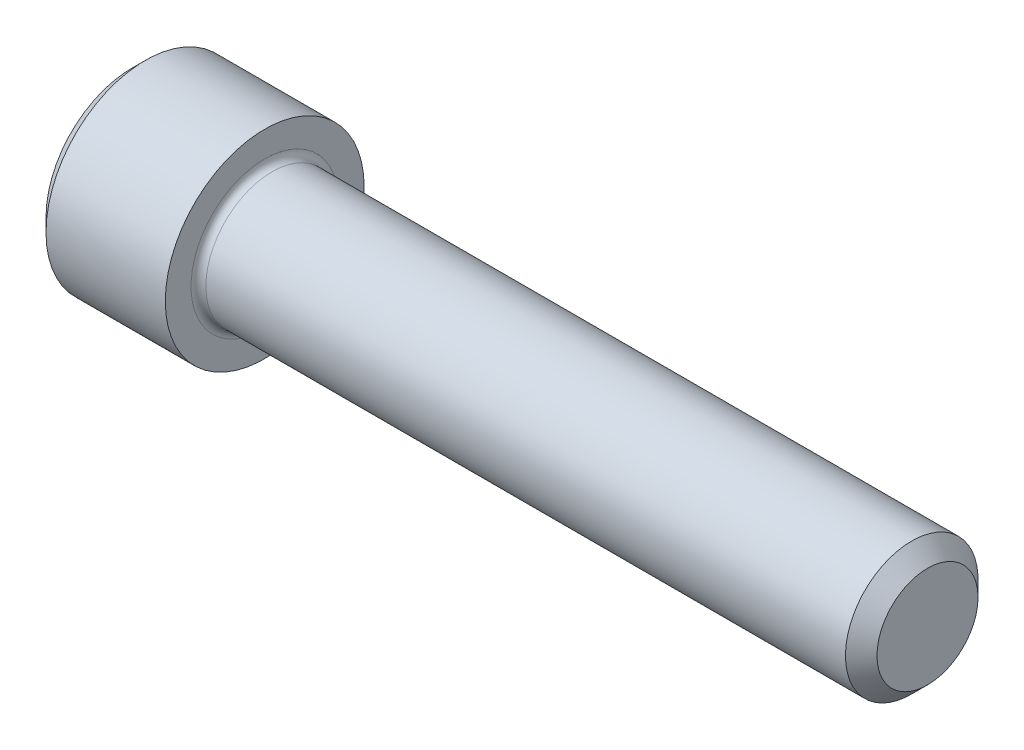
ISO-10303-21;
HEADER;
FILE_DESCRIPTION(('STEP AP214'),'2;1');
FILE_NAME('part.step','',(''),(''),'','','');
FILE_SCHEMA(('AUTOMOTIVE_DESIGN { 1 0 10303 214 1 1 1 1 }'));
ENDSEC;
DATA;
#1=APPLICATION_CONTEXT('core data for automotive mechanical design processes');
#2=APPLICATION_PROTOCOL_DEFINITION('international standard','automotive_design',2000,#1);
#3=PRODUCT_CONTEXT('',#1,'mechanical');
#4=PRODUCT('Part','Part','',(#3));
#5=PRODUCT_RELATED_PRODUCT_CATEGORY('part','',(#4));
#6=PRODUCT_DEFINITION_FORMATION('','',#4);
#7=PRODUCT_DEFINITION_CONTEXT('part definition',#1,'design');
#8=PRODUCT_DEFINITION('design','',#6,#7);
#9=PRODUCT_DEFINITION_SHAPE('','',#8);
#10=(LENGTH_UNIT() NAMED_UNIT(*) SI_UNIT(.MILLI.,.METRE.));
#11=(NAMED_UNIT(*) PLANE_ANGLE_UNIT() SI_UNIT($,.RADIAN.));
#12=(NAMED_UNIT(*) SI_UNIT($,.STERADIAN.) SOLID_ANGLE_UNIT());
#13=UNCERTAINTY_MEASURE_WITH_UNIT(LENGTH_MEASURE(1.E-05),#10,'distance_accuracy_value','');
#14=(GEOMETRIC_REPRESENTATION_CONTEXT(3) GLOBAL_UNCERTAINTY_ASSIGNED_CONTEXT((#13)) GLOBAL_UNIT_ASSIGNED_CONTEXT((#10,
#11,#12)) REPRESENTATION_CONTEXT('',''));
#15=CARTESIAN_POINT('',(0.,0.,0.));
#16=DIRECTION('',(0.,0.,1.));
#17=DIRECTION('',(1.,0.,0.));
#18=AXIS2_PLACEMENT_3D('',#15,#16,#17);
#19=CARTESIAN_POINT('',(0.,0.,0.));
#20=DIRECTION('',(-1.,0.,0.));
#21=DIRECTION('',(0.,0.,1.));
#22=AXIS2_PLACEMENT_3D('',#19,#20,#21);
#23=PLANE('',#22);
#24=DIRECTION('',(0.,-0.499999999999998,0.86602540378444));
#25=VECTOR('',#24,1.);
#26=CARTESIAN_POINT('',(0.,2.7496306570156,0.));
#27=LINE('',#26,#25);
#28=CARTESIAN_POINT('',(0.,2.7496306570156,0.));
#29=VERTEX_POINT('',#28);
#30=CARTESIAN_POINT('',(0.,1.37481532850781,2.38125));
#31=VERTEX_POINT('',#30);
#32=EDGE_CURVE('E265',#29,#31,#27,.T.);
#33=ORIENTED_EDGE('',*,*,#32,.T.);
#34=DIRECTION('',(0.,1.,0.));
#35=VECTOR('',#34,1.);
#36=CARTESIAN_POINT('',(0.,-1.37481532850779,2.38125));
#37=LINE('',#36,#35);
#38=CARTESIAN_POINT('',(0.,-1.37481532850779,2.38125));
#39=VERTEX_POINT('',#38);
#40=EDGE_CURVE('E125',#39,#31,#37,.T.);
#41=ORIENTED_EDGE('',*,*,#40,.F.);
#42=DIRECTION('',(0.,-0.500000000000001,-0.866025403784438));
#43=VECTOR('',#42,1.);
#44=CARTESIAN_POINT('',(0.,-1.37481532850779,2.38125));
#45=LINE('',#44,#43);
#46=CARTESIAN_POINT('',(0.,-2.74963065701559,0.));
#47=VERTEX_POINT('',#46);
#48=EDGE_CURVE('E268',#39,#47,#45,.T.);
#49=ORIENTED_EDGE('',*,*,#48,.T.);
#50=DIRECTION('',(0.,0.499999999999998,-0.86602540378444));
#51=VECTOR('',#50,1.);
#52=CARTESIAN_POINT('',(0.,-2.74963065701559,0.));
#53=LINE('',#52,#51);
#54=CARTESIAN_POINT('',(0.,-1.37481532850779,-2.38125));
#55=VERTEX_POINT('',#54);
#56=EDGE_CURVE('E271',#47,#55,#53,.T.);
#57=ORIENTED_EDGE('',*,*,#56,.T.);
#58=DIRECTION('',(0.,-1.,0.));
#59=VECTOR('',#58,1.);
#60=CARTESIAN_POINT('',(0.,1.3748153285078,-2.38125000000001));
#61=LINE('',#60,#59);
#62=CARTESIAN_POINT('',(0.,1.3748153285078,-2.38125000000001));
#63=VERTEX_POINT('',#62);
#64=EDGE_CURVE('E274',#63,#55,#61,.T.);
#65=ORIENTED_EDGE('',*,*,#64,.F.);
#66=DIRECTION('',(0.,-0.500000000000001,-0.866025403784438));
#67=VECTOR('',#66,1.);
#68=CARTESIAN_POINT('',(0.,2.7496306570156,0.));
#69=LINE('',#68,#67);
#70=EDGE_CURVE('E120',#29,#63,#69,.T.);
#71=ORIENTED_EDGE('',*,*,#70,.F.);
#72=EDGE_LOOP('',(#33,#41,#49,#57,#65,#71));
#73=FACE_BOUND('',#72,.T.);
#74=CARTESIAN_POINT('',(0.,0.,0.));
#75=DIRECTION('',(-1.,0.,0.));
#76=DIRECTION('',(0.,0.,1.));
#77=AXIS2_PLACEMENT_3D('',#74,#75,#76);
#78=CIRCLE('',#77,4.12749999999999);
#79=CARTESIAN_POINT('',(0.,0.,4.12749999999999));
#80=VERTEX_POINT('',#79);
#81=EDGE_CURVE('E149',#80,#80,#78,.T.);
#82=ORIENTED_EDGE('',*,*,#81,.T.);
#83=EDGE_LOOP('',(#82));
#84=FACE_BOUND('',#83,.T.);
#85=ADVANCED_FACE('F33',(#73,#84),#23,.T.);
#86=CARTESIAN_POINT('',(0.,0.,0.));
#87=DIRECTION('',(1.,0.,0.));
#88=DIRECTION('',(0.,0.,-1.));
#89=AXIS2_PLACEMENT_3D('',#86,#87,#88);
#90=CONICAL_SURFACE('',#89,4.12749999999999,0.785398163397451);
#91=CARTESIAN_POINT('',(0.635000000000011,0.,0.));
#92=DIRECTION('',(-1.,0.,0.));
#93=DIRECTION('',(0.,0.,1.));
#94=AXIS2_PLACEMENT_3D('',#91,#92,#93);
#95=CIRCLE('',#94,4.7625);
#96=CARTESIAN_POINT('',(0.635000000000011,0.,4.7625));
#97=VERTEX_POINT('',#96);
#98=EDGE_CURVE('E146',#97,#97,#95,.T.);
#99=ORIENTED_EDGE('',*,*,#98,.T.);
#100=EDGE_LOOP('',(#99));
#101=FACE_BOUND('',#100,.T.);
#102=ORIENTED_EDGE('',*,*,#81,.F.);
#103=EDGE_LOOP('',(#102));
#104=FACE_BOUND('',#103,.T.);
#105=ADVANCED_FACE('F170',(#101,#104),#90,.T.);
#106=CARTESIAN_POINT('',(-31.75,0.,0.));
#107=DIRECTION('',(-1.,0.,0.));
#108=DIRECTION('',(0.,0.,1.));
#109=AXIS2_PLACEMENT_3D('',#106,#107,#108);
#110=CYLINDRICAL_SURFACE('',#109,4.7625);
#111=CARTESIAN_POINT('',(6.35000000000001,0.,0.));
#112=DIRECTION('',(-1.,0.,0.));
#113=DIRECTION('',(0.,0.,1.));
#114=AXIS2_PLACEMENT_3D('',#111,#112,#113);
#115=CIRCLE('',#114,4.7625);
#116=CARTESIAN_POINT('',(6.35000000000001,0.,4.7625));
#117=VERTEX_POINT('',#116);
#118=EDGE_CURVE('E143',#117,#117,#115,.T.);
#119=ORIENTED_EDGE('',*,*,#118,.T.);
#120=EDGE_LOOP('',(#119));
#121=FACE_BOUND('',#120,.T.);
#122=ORIENTED_EDGE('',*,*,#98,.F.);
#123=EDGE_LOOP('',(#122));
#124=FACE_BOUND('',#123,.T.);
#125=ADVANCED_FACE('F175',(#121,#124),#110,.T.);
#126=CARTESIAN_POINT('',(6.35000000000001,4.7625,0.));
#127=DIRECTION('',(1.,0.,0.));
#128=DIRECTION('',(0.,0.,-1.));
#129=AXIS2_PLACEMENT_3D('',#126,#127,#128);
#130=PLANE('',#129);
#131=CARTESIAN_POINT('',(6.35000000000001,0.,0.));
#132=DIRECTION('',(1.,0.,0.));
#133=DIRECTION('',(0.,0.,-1.));
#134=AXIS2_PLACEMENT_3D('',#131,#132,#133);
#135=CIRCLE('',#134,3.5306);
#136=CARTESIAN_POINT('',(6.35000000000001,0.,-3.5306));
#137=VERTEX_POINT('',#136);
#138=EDGE_CURVE('E41',#137,#137,#135,.F.);
#139=ORIENTED_EDGE('',*,*,#138,.T.);
#140=EDGE_LOOP('',(#139));
#141=FACE_BOUND('',#140,.T.);
#142=ORIENTED_EDGE('',*,*,#118,.F.);
#143=EDGE_LOOP('',(#142));
#144=FACE_BOUND('',#143,.T.);
#145=ADVANCED_FACE('F154',(#141,#144),#130,.T.);
#146=CARTESIAN_POINT('',(-31.75,0.,0.));
#147=DIRECTION('',(-1.,0.,0.));
#148=DIRECTION('',(0.,0.,1.));
#149=AXIS2_PLACEMENT_3D('',#146,#147,#148);
#150=CYLINDRICAL_SURFACE('',#149,3.175);
#151=CARTESIAN_POINT('',(6.70560000000001,0.,0.));
#152=DIRECTION('',(1.,0.,0.));
#153=DIRECTION('',(0.,0.,-1.));
#154=AXIS2_PLACEMENT_3D('',#151,#152,#153);
#155=CIRCLE('',#154,3.175);
#156=CARTESIAN_POINT('',(6.70560000000001,0.,-3.175));
#157=VERTEX_POINT('',#156);
#158=EDGE_CURVE('E11',#157,#157,#155,.T.);
#159=ORIENTED_EDGE('',*,*,#158,.T.);
#160=EDGE_LOOP('',(#159));
#161=FACE_BOUND('',#160,.T.);
#162=CARTESIAN_POINT('',(37.34435,0.,0.));
#163=DIRECTION('',(-1.,0.,0.));
#164=DIRECTION('',(0.,0.,1.));
#165=AXIS2_PLACEMENT_3D('',#162,#163,#164);
#166=CIRCLE('',#165,3.175);
#167=CARTESIAN_POINT('',(37.34435,0.,3.175));
#168=VERTEX_POINT('',#167);
#169=EDGE_CURVE('E140',#168,#168,#166,.T.);
#170=ORIENTED_EDGE('',*,*,#169,.T.);
#171=EDGE_LOOP('',(#170));
#172=FACE_BOUND('',#171,.T.);
#173=ADVANCED_FACE('F185',(#161,#172),#150,.T.);
#174=CARTESIAN_POINT('',(38.1,0.,0.));
#175=DIRECTION('',(-1.,0.,0.));
#176=DIRECTION('',(0.,0.,1.));
#177=AXIS2_PLACEMENT_3D('',#174,#175,#176);
#178=CONICAL_SURFACE('',#177,2.41935,0.78539816339747);
#179=ORIENTED_EDGE('',*,*,#169,.F.);
#180=EDGE_LOOP('',(#179));
#181=FACE_BOUND('',#180,.T.);
#182=CARTESIAN_POINT('',(38.1,0.,0.));
#183=DIRECTION('',(-1.,0.,0.));
#184=DIRECTION('',(0.,0.,1.));
#185=AXIS2_PLACEMENT_3D('',#182,#183,#184);
#186=CIRCLE('',#185,2.41935);
#187=CARTESIAN_POINT('',(38.1,0.,2.41935));
#188=VERTEX_POINT('',#187);
#189=EDGE_CURVE('E136',#188,#188,#186,.T.);
#190=ORIENTED_EDGE('',*,*,#189,.T.);
#191=EDGE_LOOP('',(#190));
#192=FACE_BOUND('',#191,.T.);
#193=ADVANCED_FACE('F165',(#181,#192),#178,.T.);
#194=CARTESIAN_POINT('',(38.1,2.41935,0.));
#195=DIRECTION('',(1.,0.,0.));
#196=DIRECTION('',(0.,0.,-1.));
#197=AXIS2_PLACEMENT_3D('',#194,#195,#196);
#198=PLANE('',#197);
#199=ORIENTED_EDGE('',*,*,#189,.F.);
#200=EDGE_LOOP('',(#199));
#201=FACE_BOUND('',#200,.T.);
#202=ADVANCED_FACE('F158',(#201),#198,.T.);
#203=CARTESIAN_POINT('',(6.70560000000001,0.,0.));
#204=DIRECTION('',(1.,0.,0.));
#205=DIRECTION('',(0.,0.,-1.));
#206=AXIS2_PLACEMENT_3D('',#203,#204,#205);
#207=TOROIDAL_SURFACE('',#206,3.5306,0.3556);
#208=ORIENTED_EDGE('',*,*,#158,.F.);
#209=EDGE_LOOP('',(#208));
#210=FACE_BOUND('',#209,.T.);
#211=ORIENTED_EDGE('',*,*,#138,.F.);
#212=EDGE_LOOP('',(#211));
#213=FACE_BOUND('',#212,.T.);
#214=ADVANCED_FACE('F35',(#210,#213),#207,.F.);
#215=CARTESIAN_POINT('',(3.048,2.7496306570156,0.));
#216=DIRECTION('',(0.,-0.86602540378444,-0.499999999999998));
#217=DIRECTION('',(0.,0.499999999999998,-0.86602540378444));
#218=AXIS2_PLACEMENT_3D('',#215,#216,#217);
#219=PLANE('',#218);
#220=ORIENTED_EDGE('',*,*,#32,.F.);
#221=DIRECTION('',(-1.,0.,0.));
#222=VECTOR('',#221,1.);
#223=CARTESIAN_POINT('',(3.048,2.7496306570156,0.));
#224=LINE('',#223,#222);
#225=CARTESIAN_POINT('',(3.048,2.7496306570156,0.));
#226=VERTEX_POINT('',#225);
#227=EDGE_CURVE('E264',#226,#29,#224,.T.);
#228=ORIENTED_EDGE('',*,*,#227,.F.);
#229=DIRECTION('',(0.,-0.499999999999998,0.86602540378444));
#230=VECTOR('',#229,1.);
#231=CARTESIAN_POINT('',(3.048,2.7496306570156,0.));
#232=LINE('',#231,#230);
#233=CARTESIAN_POINT('',(3.04800000000001,2.0622229927617,1.19062499999999));
#234=VERTEX_POINT('',#233);
#235=EDGE_CURVE('E48',#226,#234,#232,.T.);
#236=ORIENTED_EDGE('',*,*,#235,.T.);
#237=CARTESIAN_POINT('',(3.048,1.37481532850781,2.38125));
#238=VERTEX_POINT('',#237);
#239=EDGE_CURVE('E106',#234,#238,#232,.T.);
#240=ORIENTED_EDGE('',*,*,#239,.T.);
#241=DIRECTION('',(-1.,0.,0.));
#242=VECTOR('',#241,1.);
#243=CARTESIAN_POINT('',(3.048,1.37481532850781,2.38125));
#244=LINE('',#243,#242);
#245=EDGE_CURVE('E118',#238,#31,#244,.T.);
#246=ORIENTED_EDGE('',*,*,#245,.T.);
#247=EDGE_LOOP('',(#220,#228,#236,#240,#246));
#248=FACE_BOUND('',#247,.T.);
#249=ADVANCED_FACE('F117',(#248),#219,.T.);
#250=CARTESIAN_POINT('',(3.048,-1.37481532850779,2.38125));
#251=DIRECTION('',(0.,0.,1.));
#252=DIRECTION('',(0.,-1.,0.));
#253=AXIS2_PLACEMENT_3D('',#250,#251,#252);
#254=PLANE('',#253);
#255=ORIENTED_EDGE('',*,*,#40,.T.);
#256=ORIENTED_EDGE('',*,*,#245,.F.);
#257=DIRECTION('',(0.,1.,0.));
#258=VECTOR('',#257,1.);
#259=CARTESIAN_POINT('',(3.048,-1.37481532850779,2.38125));
#260=LINE('',#259,#258);
#261=CARTESIAN_POINT('',(3.048,0.,2.38125));
#262=VERTEX_POINT('',#261);
#263=EDGE_CURVE('E104',#262,#238,#260,.T.);
#264=ORIENTED_EDGE('',*,*,#263,.F.);
#265=CARTESIAN_POINT('',(3.048,-1.37481532850779,2.38125));
#266=VERTEX_POINT('',#265);
#267=EDGE_CURVE('E114',#266,#262,#260,.T.);
#268=ORIENTED_EDGE('',*,*,#267,.F.);
#269=DIRECTION('',(-1.,0.,0.));
#270=VECTOR('',#269,1.);
#271=CARTESIAN_POINT('',(3.048,-1.37481532850779,2.38125));
#272=LINE('',#271,#270);
#273=EDGE_CURVE('E127',#266,#39,#272,.T.);
#274=ORIENTED_EDGE('',*,*,#273,.T.);
#275=EDGE_LOOP('',(#255,#256,#264,#268,#274));
#276=FACE_BOUND('',#275,.T.);
#277=ADVANCED_FACE('F122',(#276),#254,.F.);
#278=CARTESIAN_POINT('',(3.048,-1.37481532850779,2.38125));
#279=DIRECTION('',(0.,0.866025403784438,-0.500000000000001));
#280=DIRECTION('',(0.,0.500000000000001,0.866025403784438));
#281=AXIS2_PLACEMENT_3D('',#278,#279,#280);
#282=PLANE('',#281);
#283=ORIENTED_EDGE('',*,*,#48,.F.);
#284=ORIENTED_EDGE('',*,*,#273,.F.);
#285=DIRECTION('',(0.,-0.500000000000001,-0.866025403784438));
#286=VECTOR('',#285,1.);
#287=CARTESIAN_POINT('',(3.048,-1.37481532850779,2.38125));
#288=LINE('',#287,#286);
#289=CARTESIAN_POINT('',(3.048,-2.06222299276169,1.190625));
#290=VERTEX_POINT('',#289);
#291=EDGE_CURVE('E245',#266,#290,#288,.T.);
#292=ORIENTED_EDGE('',*,*,#291,.T.);
#293=CARTESIAN_POINT('',(3.048,-2.74963065701559,0.));
#294=VERTEX_POINT('',#293);
#295=EDGE_CURVE('E247',#290,#294,#288,.T.);
#296=ORIENTED_EDGE('',*,*,#295,.T.);
#297=DIRECTION('',(-1.,0.,0.));
#298=VECTOR('',#297,1.);
#299=CARTESIAN_POINT('',(3.048,-2.74963065701559,0.));
#300=LINE('',#299,#298);
#301=EDGE_CURVE('E132',#294,#47,#300,.T.);
#302=ORIENTED_EDGE('',*,*,#301,.T.);
#303=EDGE_LOOP('',(#283,#284,#292,#296,#302));
#304=FACE_BOUND('',#303,.T.);
#305=ADVANCED_FACE('F197',(#304),#282,.T.);
#306=CARTESIAN_POINT('',(3.048,-2.74963065701559,0.));
#307=DIRECTION('',(0.,0.86602540378444,0.499999999999998));
#308=DIRECTION('',(0.,-0.499999999999998,0.86602540378444));
#309=AXIS2_PLACEMENT_3D('',#306,#307,#308);
#310=PLANE('',#309);
#311=ORIENTED_EDGE('',*,*,#56,.F.);
#312=ORIENTED_EDGE('',*,*,#301,.F.);
#313=DIRECTION('',(0.,0.499999999999998,-0.86602540378444));
#314=VECTOR('',#313,1.);
#315=CARTESIAN_POINT('',(3.048,-2.74963065701559,0.));
#316=LINE('',#315,#314);
#317=CARTESIAN_POINT('',(3.048,-2.06222299276169,-1.19062499999999));
#318=VERTEX_POINT('',#317);
#319=EDGE_CURVE('E250',#294,#318,#316,.T.);
#320=ORIENTED_EDGE('',*,*,#319,.T.);
#321=CARTESIAN_POINT('',(3.048,-1.37481532850779,-2.38125));
#322=VERTEX_POINT('',#321);
#323=EDGE_CURVE('E254',#318,#322,#316,.T.);
#324=ORIENTED_EDGE('',*,*,#323,.T.);
#325=DIRECTION('',(-1.,0.,0.));
#326=VECTOR('',#325,1.);
#327=CARTESIAN_POINT('',(3.048,-1.37481532850779,-2.38125));
#328=LINE('',#327,#326);
#329=EDGE_CURVE('E283',#322,#55,#328,.T.);
#330=ORIENTED_EDGE('',*,*,#329,.T.);
#331=EDGE_LOOP('',(#311,#312,#320,#324,#330));
#332=FACE_BOUND('',#331,.T.);
#333=ADVANCED_FACE('F200',(#332),#310,.T.);
#334=CARTESIAN_POINT('',(3.048,1.3748153285078,-2.38125000000001));
#335=DIRECTION('',(0.,0.,-1.));
#336=DIRECTION('',(0.,1.,0.));
#337=AXIS2_PLACEMENT_3D('',#334,#335,#336);
#338=PLANE('',#337);
#339=ORIENTED_EDGE('',*,*,#64,.T.);
#340=ORIENTED_EDGE('',*,*,#329,.F.);
#341=DIRECTION('',(0.,-1.,0.));
#342=VECTOR('',#341,1.);
#343=CARTESIAN_POINT('',(3.048,1.3748153285078,-2.38125000000001));
#344=LINE('',#343,#342);
#345=CARTESIAN_POINT('',(3.048,0.,-2.38125));
#346=VERTEX_POINT('',#345);
#347=EDGE_CURVE('E258',#346,#322,#344,.T.);
#348=ORIENTED_EDGE('',*,*,#347,.F.);
#349=CARTESIAN_POINT('',(3.048,1.3748153285078,-2.38125000000001));
#350=VERTEX_POINT('',#349);
#351=EDGE_CURVE('E259',#350,#346,#344,.T.);
#352=ORIENTED_EDGE('',*,*,#351,.F.);
#353=DIRECTION('',(-1.,0.,0.));
#354=VECTOR('',#353,1.);
#355=CARTESIAN_POINT('',(3.048,1.3748153285078,-2.38125000000001));
#356=LINE('',#355,#354);
#357=EDGE_CURVE('E280',#350,#63,#356,.T.);
#358=ORIENTED_EDGE('',*,*,#357,.T.);
#359=EDGE_LOOP('',(#339,#340,#348,#352,#358));
#360=FACE_BOUND('',#359,.T.);
#361=ADVANCED_FACE('F204',(#360),#338,.F.);
#362=CARTESIAN_POINT('',(3.048,2.7496306570156,0.));
#363=DIRECTION('',(0.,0.866025403784438,-0.500000000000001));
#364=DIRECTION('',(0.,0.500000000000001,0.866025403784438));
#365=AXIS2_PLACEMENT_3D('',#362,#363,#364);
#366=PLANE('',#365);
#367=ORIENTED_EDGE('',*,*,#70,.T.);
#368=ORIENTED_EDGE('',*,*,#357,.F.);
#369=DIRECTION('',(0.,-0.500000000000001,-0.866025403784438));
#370=VECTOR('',#369,1.);
#371=CARTESIAN_POINT('',(3.048,2.7496306570156,0.));
#372=LINE('',#371,#370);
#373=CARTESIAN_POINT('',(3.048,2.0622229927617,-1.19062500000001));
#374=VERTEX_POINT('',#373);
#375=EDGE_CURVE('E262',#374,#350,#372,.T.);
#376=ORIENTED_EDGE('',*,*,#375,.F.);
#377=EDGE_CURVE('E236',#226,#374,#372,.T.);
#378=ORIENTED_EDGE('',*,*,#377,.F.);
#379=ORIENTED_EDGE('',*,*,#227,.T.);
#380=EDGE_LOOP('',(#367,#368,#376,#378,#379));
#381=FACE_BOUND('',#380,.T.);
#382=ADVANCED_FACE('F208',(#381),#366,.F.);
#383=CARTESIAN_POINT('',(3.048,1.37481532850781,2.38125));
#384=DIRECTION('',(-1.,0.,0.));
#385=DIRECTION('',(0.,0.,1.));
#386=AXIS2_PLACEMENT_3D('',#383,#384,#385);
#387=PLANE('',#386);
#388=CARTESIAN_POINT('',(3.04800000000001,0.,0.));
#389=DIRECTION('',(-1.,0.,0.));
#390=DIRECTION('',(0.,0.,1.));
#391=AXIS2_PLACEMENT_3D('',#388,#389,#390);
#392=CIRCLE('',#391,2.38125);
#393=EDGE_CURVE('E126',#290,#262,#392,.T.);
#394=ORIENTED_EDGE('',*,*,#393,.F.);
#395=ORIENTED_EDGE('',*,*,#291,.F.);
#396=ORIENTED_EDGE('',*,*,#267,.T.);
#397=EDGE_LOOP('',(#394,#395,#396));
#398=FACE_BOUND('',#397,.T.);
#399=ADVANCED_FACE('F212',(#398),#387,.T.);
#400=EDGE_CURVE('E130',#318,#290,#392,.T.);
#401=ORIENTED_EDGE('',*,*,#400,.F.);
#402=ORIENTED_EDGE('',*,*,#319,.F.);
#403=ORIENTED_EDGE('',*,*,#295,.F.);
#404=EDGE_LOOP('',(#401,#402,#403));
#405=FACE_BOUND('',#404,.T.);
#406=ADVANCED_FACE('F215',(#405),#387,.T.);
#407=EDGE_CURVE('E289',#346,#318,#392,.T.);
#408=ORIENTED_EDGE('',*,*,#407,.F.);
#409=ORIENTED_EDGE('',*,*,#347,.T.);
#410=ORIENTED_EDGE('',*,*,#323,.F.);
#411=EDGE_LOOP('',(#408,#409,#410));
#412=FACE_BOUND('',#411,.T.);
#413=ADVANCED_FACE('F220',(#412),#387,.T.);
#414=EDGE_CURVE('E239',#374,#346,#392,.T.);
#415=ORIENTED_EDGE('',*,*,#414,.F.);
#416=ORIENTED_EDGE('',*,*,#375,.T.);
#417=ORIENTED_EDGE('',*,*,#351,.T.);
#418=EDGE_LOOP('',(#415,#416,#417));
#419=FACE_BOUND('',#418,.T.);
#420=ADVANCED_FACE('F227',(#419),#387,.T.);
#421=EDGE_CURVE('E137',#234,#374,#392,.T.);
#422=ORIENTED_EDGE('',*,*,#421,.F.);
#423=ORIENTED_EDGE('',*,*,#235,.F.);
#424=ORIENTED_EDGE('',*,*,#377,.T.);
#425=EDGE_LOOP('',(#422,#423,#424));
#426=FACE_BOUND('',#425,.T.);
#427=ADVANCED_FACE('F223',(#426),#387,.T.);
#428=EDGE_CURVE('E109',#262,#234,#392,.T.);
#429=ORIENTED_EDGE('',*,*,#428,.F.);
#430=ORIENTED_EDGE('',*,*,#263,.T.);
#431=ORIENTED_EDGE('',*,*,#239,.F.);
#432=EDGE_LOOP('',(#429,#430,#431));
#433=FACE_BOUND('',#432,.T.);
#434=ADVANCED_FACE('F105',(#433),#387,.T.);
#435=CARTESIAN_POINT('',(3.04800000000001,0.,0.));
#436=DIRECTION('',(-1.,0.,0.));
#437=DIRECTION('',(0.,0.,1.));
#438=AXIS2_PLACEMENT_3D('',#435,#436,#437);
#439=CONICAL_SURFACE('',#438,2.38125,1.04719755119659);
#440=CARTESIAN_POINT('',(4.42281532850782,0.,0.));
#441=VERTEX_POINT('',#440);
#442=VERTEX_LOOP('',#441);
#443=FACE_BOUND('',#442,.T.);
#444=ORIENTED_EDGE('',*,*,#428,.T.);
#445=ORIENTED_EDGE('',*,*,#421,.T.);
#446=ORIENTED_EDGE('',*,*,#414,.T.);
#447=ORIENTED_EDGE('',*,*,#407,.T.);
#448=ORIENTED_EDGE('',*,*,#400,.T.);
#449=ORIENTED_EDGE('',*,*,#393,.T.);
#450=EDGE_LOOP('',(#444,#445,#446,#447,#448,#449));
#451=FACE_BOUND('',#450,.T.);
#452=ADVANCED_FACE('F192',(#443,#451),#439,.F.);
#453=CLOSED_SHELL('',(#85,#105,#125,#145,#173,#193,#202,#214,#249,#277,#305,#333,#361,#382,#399,
#406,#413,#420,#427,#434,#452));
#454=MANIFOLD_SOLID_BREP('B2',#453);
#455=ADVANCED_BREP_SHAPE_REPRESENTATION('',(#18,#454),#14);
#456=SHAPE_DEFINITION_REPRESENTATION(#9,#455);
ENDSEC;
END-ISO-10303-21;
